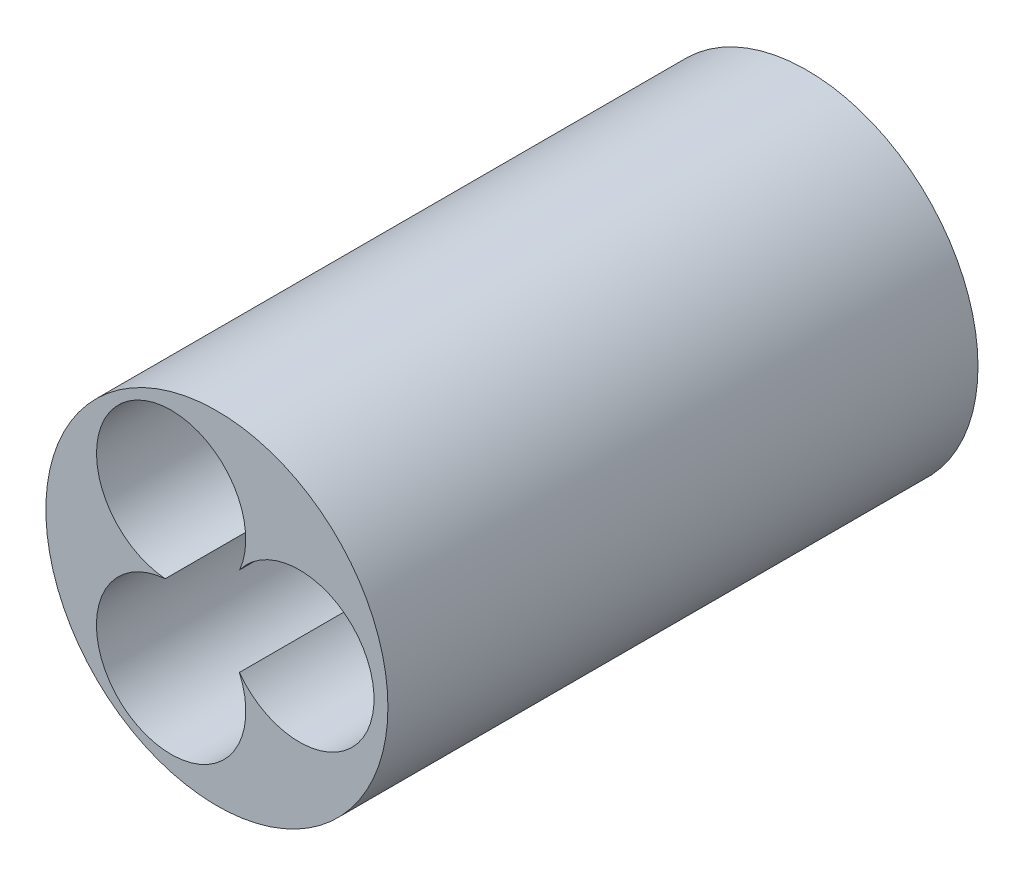
ISO-10303-21;
HEADER;
FILE_DESCRIPTION(('STEP AP214'),'2;1');
FILE_NAME('part.step','',(''),(''),'','','');
FILE_SCHEMA(('AUTOMOTIVE_DESIGN { 1 0 10303 214 1 1 1 1 }'));
ENDSEC;
DATA;
#1=APPLICATION_CONTEXT('core data for automotive mechanical design processes');
#2=APPLICATION_PROTOCOL_DEFINITION('international standard','automotive_design',2000,#1);
#3=PRODUCT_CONTEXT('',#1,'mechanical');
#4=PRODUCT('Part','Part','',(#3));
#5=PRODUCT_RELATED_PRODUCT_CATEGORY('part','',(#4));
#6=PRODUCT_DEFINITION_FORMATION('','',#4);
#7=PRODUCT_DEFINITION_CONTEXT('part definition',#1,'design');
#8=PRODUCT_DEFINITION('design','',#6,#7);
#9=PRODUCT_DEFINITION_SHAPE('','',#8);
#10=(LENGTH_UNIT() NAMED_UNIT(*) SI_UNIT(.MILLI.,.METRE.));
#11=(NAMED_UNIT(*) PLANE_ANGLE_UNIT() SI_UNIT($,.RADIAN.));
#12=(NAMED_UNIT(*) SI_UNIT($,.STERADIAN.) SOLID_ANGLE_UNIT());
#13=UNCERTAINTY_MEASURE_WITH_UNIT(LENGTH_MEASURE(1.E-05),#10,'distance_accuracy_value','');
#14=(GEOMETRIC_REPRESENTATION_CONTEXT(3) GLOBAL_UNCERTAINTY_ASSIGNED_CONTEXT((#13)) GLOBAL_UNIT_ASSIGNED_CONTEXT((#10,
#11,#12)) REPRESENTATION_CONTEXT('',''));
#15=CARTESIAN_POINT('',(0.,0.,0.));
#16=DIRECTION('',(0.,0.,1.));
#17=DIRECTION('',(1.,0.,0.));
#18=AXIS2_PLACEMENT_3D('',#15,#16,#17);
#19=CARTESIAN_POINT('',(15.24,8.875,70.1));
#20=DIRECTION('',(0.,0.,-1.));
#21=DIRECTION('',(-1.,0.,0.));
#22=AXIS2_PLACEMENT_3D('',#19,#20,#21);
#23=CYLINDRICAL_SURFACE('',#22,8.86460000000002);
#24=CARTESIAN_POINT('',(15.24,8.875,0.));
#25=DIRECTION('',(0.,0.,1.));
#26=DIRECTION('',(1.,0.,0.));
#27=AXIS2_PLACEMENT_3D('',#24,#25,#26);
#28=CIRCLE('',#27,8.86460000000002);
#29=CARTESIAN_POINT('',(8.10656297462022,3.61237619006059,0.));
#30=VERTEX_POINT('',#29);
#31=CARTESIAN_POINT('',(8.1494035184999,14.1952043848464,0.));
#32=VERTEX_POINT('',#31);
#33=EDGE_CURVE('E67',#30,#32,#28,.T.);
#34=ORIENTED_EDGE('',*,*,#33,.F.);
#35=DIRECTION('',(0.,0.,-1.));
#36=VECTOR('',#35,1.);
#37=CARTESIAN_POINT('',(8.10656297462022,3.61237619006059,70.1));
#38=LINE('',#37,#36);
#39=CARTESIAN_POINT('',(8.10656297462022,3.61237619006059,70.1));
#40=VERTEX_POINT('',#39);
#41=EDGE_CURVE('E11',#40,#30,#38,.T.);
#42=ORIENTED_EDGE('',*,*,#41,.F.);
#43=CARTESIAN_POINT('',(15.24,8.875,70.1));
#44=DIRECTION('',(0.,0.,1.));
#45=DIRECTION('',(1.,0.,0.));
#46=AXIS2_PLACEMENT_3D('',#43,#44,#45);
#47=CIRCLE('',#46,8.86460000000002);
#48=CARTESIAN_POINT('',(8.1494035184999,14.1952043848464,70.1));
#49=VERTEX_POINT('',#48);
#50=EDGE_CURVE('E65',#40,#49,#47,.T.);
#51=ORIENTED_EDGE('',*,*,#50,.T.);
#52=DIRECTION('',(0.,0.,-1.));
#53=VECTOR('',#52,1.);
#54=CARTESIAN_POINT('',(8.1494035184999,14.1952043848464,70.1));
#55=LINE('',#54,#53);
#56=EDGE_CURVE('E49',#49,#32,#55,.T.);
#57=ORIENTED_EDGE('',*,*,#56,.T.);
#58=EDGE_LOOP('',(#34,#42,#51,#57));
#59=FACE_BOUND('',#58,.T.);
#60=ADVANCED_FACE('F33',(#59),#23,.F.);
#61=CARTESIAN_POINT('',(0.,0.,70.1));
#62=DIRECTION('',(0.,0.,-1.));
#63=DIRECTION('',(-1.,0.,0.));
#64=AXIS2_PLACEMENT_3D('',#61,#62,#63);
#65=CYLINDRICAL_SURFACE('',#64,8.875);
#66=CARTESIAN_POINT('',(0.,0.,0.));
#67=DIRECTION('',(0.,0.,1.));
#68=DIRECTION('',(1.,0.,0.));
#69=AXIS2_PLACEMENT_3D('',#66,#67,#68);
#70=CIRCLE('',#69,8.875);
#71=CARTESIAN_POINT('',(-0.704712548932406,8.84697717999641,0.));
#72=VERTEX_POINT('',#71);
#73=EDGE_CURVE('E87',#72,#30,#70,.T.);
#74=ORIENTED_EDGE('',*,*,#73,.F.);
#75=DIRECTION('',(0.,0.,-1.));
#76=VECTOR('',#75,1.);
#77=CARTESIAN_POINT('',(-0.704712548932406,8.84697717999641,70.1));
#78=LINE('',#77,#76);
#79=CARTESIAN_POINT('',(-0.704712548932406,8.84697717999641,70.1));
#80=VERTEX_POINT('',#79);
#81=EDGE_CURVE('E41',#80,#72,#78,.T.);
#82=ORIENTED_EDGE('',*,*,#81,.F.);
#83=CARTESIAN_POINT('',(0.,0.,70.1));
#84=DIRECTION('',(0.,0.,1.));
#85=DIRECTION('',(1.,0.,0.));
#86=AXIS2_PLACEMENT_3D('',#83,#84,#85);
#87=CIRCLE('',#86,8.875);
#88=EDGE_CURVE('E75',#80,#40,#87,.T.);
#89=ORIENTED_EDGE('',*,*,#88,.T.);
#90=ORIENTED_EDGE('',*,*,#41,.T.);
#91=EDGE_LOOP('',(#74,#82,#89,#90));
#92=FACE_BOUND('',#91,.T.);
#93=ADVANCED_FACE('F79',(#92),#65,.F.);
#94=CARTESIAN_POINT('',(0.,17.6835213791377,70.1));
#95=DIRECTION('',(0.,0.,-1.));
#96=DIRECTION('',(-1.,0.,0.));
#97=AXIS2_PLACEMENT_3D('',#94,#95,#96);
#98=CYLINDRICAL_SURFACE('',#97,8.8646);
#99=CARTESIAN_POINT('',(0.,17.6835213791377,0.));
#100=DIRECTION('',(0.,0.,1.));
#101=DIRECTION('',(1.,0.,0.));
#102=AXIS2_PLACEMENT_3D('',#99,#100,#101);
#103=CIRCLE('',#102,8.8646);
#104=EDGE_CURVE('E89',#32,#72,#103,.T.);
#105=ORIENTED_EDGE('',*,*,#104,.F.);
#106=ORIENTED_EDGE('',*,*,#56,.F.);
#107=CARTESIAN_POINT('',(0.,17.6835213791377,70.1));
#108=DIRECTION('',(0.,0.,1.));
#109=DIRECTION('',(1.,0.,0.));
#110=AXIS2_PLACEMENT_3D('',#107,#108,#109);
#111=CIRCLE('',#110,8.8646);
#112=EDGE_CURVE('E76',#49,#80,#111,.T.);
#113=ORIENTED_EDGE('',*,*,#112,.T.);
#114=ORIENTED_EDGE('',*,*,#81,.T.);
#115=EDGE_LOOP('',(#105,#106,#113,#114));
#116=FACE_BOUND('',#115,.T.);
#117=ADVANCED_FACE('F111',(#116),#98,.F.);
#118=CARTESIAN_POINT('',(5.43696592456946,8.875,70.1));
#119=DIRECTION('',(0.,0.,-1.));
#120=DIRECTION('',(-1.,0.,0.));
#121=AXIS2_PLACEMENT_3D('',#118,#119,#120);
#122=CYLINDRICAL_SURFACE('',#121,20.32);
#123=CARTESIAN_POINT('',(5.43696592456946,8.875,70.1));
#124=DIRECTION('',(0.,0.,1.));
#125=DIRECTION('',(1.,0.,0.));
#126=AXIS2_PLACEMENT_3D('',#123,#124,#125);
#127=CIRCLE('',#126,20.32);
#128=CARTESIAN_POINT('',(25.7569659245695,8.875,70.1));
#129=VERTEX_POINT('',#128);
#130=EDGE_CURVE('E81',#129,#129,#127,.T.);
#131=ORIENTED_EDGE('',*,*,#130,.F.);
#132=EDGE_LOOP('',(#131));
#133=FACE_BOUND('',#132,.T.);
#134=CARTESIAN_POINT('',(5.43696592456946,8.875,0.));
#135=DIRECTION('',(0.,0.,1.));
#136=DIRECTION('',(1.,0.,0.));
#137=AXIS2_PLACEMENT_3D('',#134,#135,#136);
#138=CIRCLE('',#137,20.32);
#139=CARTESIAN_POINT('',(25.7569659245695,8.875,0.));
#140=VERTEX_POINT('',#139);
#141=EDGE_CURVE('E77',#140,#140,#138,.T.);
#142=ORIENTED_EDGE('',*,*,#141,.T.);
#143=EDGE_LOOP('',(#142));
#144=FACE_BOUND('',#143,.T.);
#145=ADVANCED_FACE('F96',(#133,#144),#122,.T.);
#146=CARTESIAN_POINT('',(0.,0.,70.1));
#147=DIRECTION('',(0.,0.,1.));
#148=DIRECTION('',(1.,0.,0.));
#149=AXIS2_PLACEMENT_3D('',#146,#147,#148);
#150=PLANE('',#149);
#151=ORIENTED_EDGE('',*,*,#50,.F.);
#152=ORIENTED_EDGE('',*,*,#88,.F.);
#153=ORIENTED_EDGE('',*,*,#112,.F.);
#154=EDGE_LOOP('',(#151,#152,#153));
#155=FACE_BOUND('',#154,.T.);
#156=ORIENTED_EDGE('',*,*,#130,.T.);
#157=EDGE_LOOP('',(#156));
#158=FACE_BOUND('',#157,.T.);
#159=ADVANCED_FACE('F73',(#155,#158),#150,.T.);
#160=CARTESIAN_POINT('',(0.,0.,0.));
#161=DIRECTION('',(0.,0.,1.));
#162=DIRECTION('',(1.,0.,0.));
#163=AXIS2_PLACEMENT_3D('',#160,#161,#162);
#164=PLANE('',#163);
#165=ORIENTED_EDGE('',*,*,#33,.T.);
#166=ORIENTED_EDGE('',*,*,#104,.T.);
#167=ORIENTED_EDGE('',*,*,#73,.T.);
#168=EDGE_LOOP('',(#165,#166,#167));
#169=FACE_BOUND('',#168,.T.);
#170=ORIENTED_EDGE('',*,*,#141,.F.);
#171=EDGE_LOOP('',(#170));
#172=FACE_BOUND('',#171,.T.);
#173=ADVANCED_FACE('F98',(#169,#172),#164,.F.);
#174=CLOSED_SHELL('',(#60,#93,#117,#145,#159,#173));
#175=MANIFOLD_SOLID_BREP('B2',#174);
#176=ADVANCED_BREP_SHAPE_REPRESENTATION('',(#18,#175),#14);
#177=SHAPE_DEFINITION_REPRESENTATION(#9,#176);
ENDSEC;
END-ISO-10303-21;
